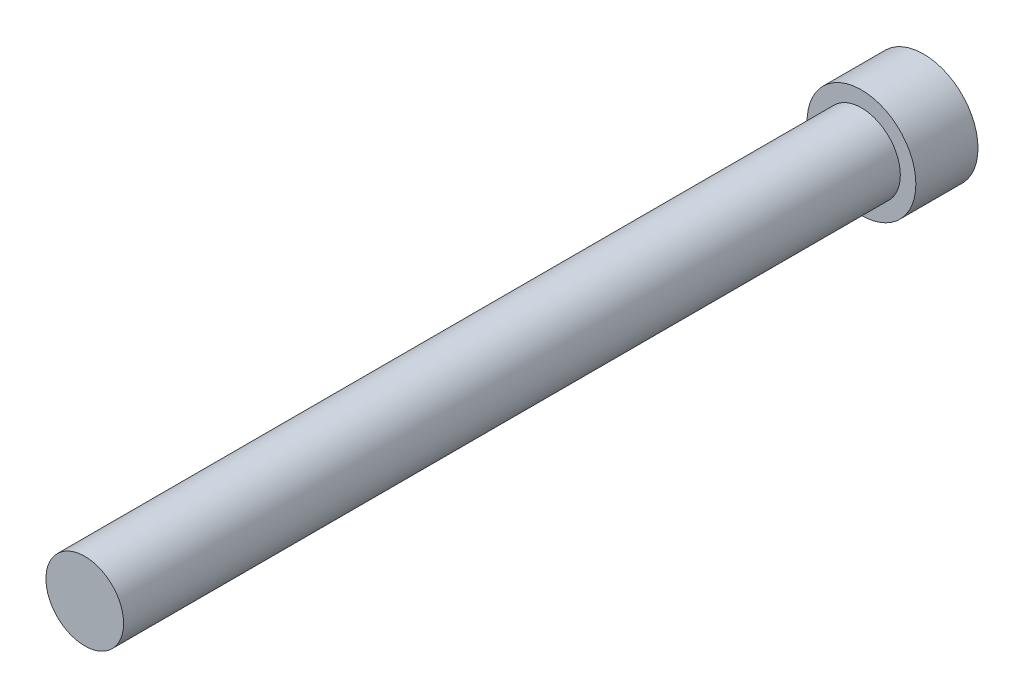
ISO-10303-21;
HEADER;
FILE_DESCRIPTION(('STEP AP214'),'2;1');
FILE_NAME('part.step','',(''),(''),'','','');
FILE_SCHEMA(('AUTOMOTIVE_DESIGN { 1 0 10303 214 1 1 1 1 }'));
ENDSEC;
DATA;
#1=APPLICATION_CONTEXT('core data for automotive mechanical design processes');
#2=APPLICATION_PROTOCOL_DEFINITION('international standard','automotive_design',2000,#1);
#3=PRODUCT_CONTEXT('',#1,'mechanical');
#4=PRODUCT('Part','Part','',(#3));
#5=PRODUCT_RELATED_PRODUCT_CATEGORY('part','',(#4));
#6=PRODUCT_DEFINITION_FORMATION('','',#4);
#7=PRODUCT_DEFINITION_CONTEXT('part definition',#1,'design');
#8=PRODUCT_DEFINITION('design','',#6,#7);
#9=PRODUCT_DEFINITION_SHAPE('','',#8);
#10=(LENGTH_UNIT() NAMED_UNIT(*) SI_UNIT(.MILLI.,.METRE.));
#11=(NAMED_UNIT(*) PLANE_ANGLE_UNIT() SI_UNIT($,.RADIAN.));
#12=(NAMED_UNIT(*) SI_UNIT($,.STERADIAN.) SOLID_ANGLE_UNIT());
#13=UNCERTAINTY_MEASURE_WITH_UNIT(LENGTH_MEASURE(1.E-05),#10,'distance_accuracy_value','');
#14=(GEOMETRIC_REPRESENTATION_CONTEXT(3) GLOBAL_UNCERTAINTY_ASSIGNED_CONTEXT((#13)) GLOBAL_UNIT_ASSIGNED_CONTEXT((#10,
#11,#12)) REPRESENTATION_CONTEXT('',''));
#15=CARTESIAN_POINT('',(0.,0.,0.));
#16=DIRECTION('',(0.,0.,1.));
#17=DIRECTION('',(1.,0.,0.));
#18=AXIS2_PLACEMENT_3D('',#15,#16,#17);
#19=CARTESIAN_POINT('',(0.,0.,68.58));
#20=DIRECTION('',(0.,0.,-1.));
#21=DIRECTION('',(-1.,0.,0.));
#22=AXIS2_PLACEMENT_3D('',#19,#20,#21);
#23=CYLINDRICAL_SURFACE('',#22,4.445);
#24=CARTESIAN_POINT('',(0.,0.,0.));
#25=DIRECTION('',(0.,0.,1.));
#26=DIRECTION('',(1.,0.,0.));
#27=AXIS2_PLACEMENT_3D('',#24,#25,#26);
#28=CIRCLE('',#27,4.445);
#29=CARTESIAN_POINT('',(4.445,0.,0.));
#30=VERTEX_POINT('',#29);
#31=EDGE_CURVE('E11',#30,#30,#28,.T.);
#32=ORIENTED_EDGE('',*,*,#31,.T.);
#33=EDGE_LOOP('',(#32));
#34=FACE_BOUND('',#33,.T.);
#35=CARTESIAN_POINT('',(0.,0.,5.08));
#36=DIRECTION('',(0.,0.,1.));
#37=DIRECTION('',(1.,0.,0.));
#38=AXIS2_PLACEMENT_3D('',#35,#36,#37);
#39=CIRCLE('',#38,4.445);
#40=CARTESIAN_POINT('',(4.445,0.,5.08));
#41=VERTEX_POINT('',#40);
#42=EDGE_CURVE('E39',#41,#41,#39,.T.);
#43=ORIENTED_EDGE('',*,*,#42,.F.);
#44=EDGE_LOOP('',(#43));
#45=FACE_BOUND('',#44,.T.);
#46=ADVANCED_FACE('F36',(#34,#45),#23,.T.);
#47=CARTESIAN_POINT('',(0.,0.,0.));
#48=DIRECTION('',(0.,0.,1.));
#49=DIRECTION('',(1.,0.,0.));
#50=AXIS2_PLACEMENT_3D('',#47,#48,#49);
#51=PLANE('',#50);
#52=ORIENTED_EDGE('',*,*,#31,.F.);
#53=EDGE_LOOP('',(#52));
#54=FACE_BOUND('',#53,.T.);
#55=ADVANCED_FACE('F60',(#54),#51,.F.);
#56=CARTESIAN_POINT('',(0.,0.,5.08));
#57=DIRECTION('',(0.,0.,1.));
#58=DIRECTION('',(1.,0.,0.));
#59=AXIS2_PLACEMENT_3D('',#56,#57,#58);
#60=PLANE('',#59);
#61=CARTESIAN_POINT('',(0.,0.,5.08));
#62=DIRECTION('',(0.,0.,1.));
#63=DIRECTION('',(1.,0.,0.));
#64=AXIS2_PLACEMENT_3D('',#61,#62,#63);
#65=CIRCLE('',#64,3.175);
#66=CARTESIAN_POINT('',(3.175,0.,5.08));
#67=VERTEX_POINT('',#66);
#68=EDGE_CURVE('E46',#67,#67,#65,.T.);
#69=ORIENTED_EDGE('',*,*,#68,.F.);
#70=EDGE_LOOP('',(#69));
#71=FACE_BOUND('',#70,.T.);
#72=ORIENTED_EDGE('',*,*,#42,.T.);
#73=EDGE_LOOP('',(#72));
#74=FACE_BOUND('',#73,.T.);
#75=ADVANCED_FACE('F57',(#71,#74),#60,.T.);
#76=CARTESIAN_POINT('',(0.,0.,5.08));
#77=DIRECTION('',(0.,0.,1.));
#78=DIRECTION('',(1.,0.,0.));
#79=AXIS2_PLACEMENT_3D('',#76,#77,#78);
#80=CYLINDRICAL_SURFACE('',#79,3.175);
#81=ORIENTED_EDGE('',*,*,#68,.T.);
#82=EDGE_LOOP('',(#81));
#83=FACE_BOUND('',#82,.T.);
#84=CARTESIAN_POINT('',(0.,0.,68.58));
#85=DIRECTION('',(0.,0.,1.));
#86=DIRECTION('',(1.,0.,0.));
#87=AXIS2_PLACEMENT_3D('',#84,#85,#86);
#88=CIRCLE('',#87,3.175);
#89=CARTESIAN_POINT('',(3.175,0.,68.58));
#90=VERTEX_POINT('',#89);
#91=EDGE_CURVE('E48',#90,#90,#88,.T.);
#92=ORIENTED_EDGE('',*,*,#91,.F.);
#93=EDGE_LOOP('',(#92));
#94=FACE_BOUND('',#93,.T.);
#95=ADVANCED_FACE('F54',(#83,#94),#80,.T.);
#96=CARTESIAN_POINT('',(0.,0.,68.58));
#97=DIRECTION('',(0.,0.,1.));
#98=DIRECTION('',(1.,0.,0.));
#99=AXIS2_PLACEMENT_3D('',#96,#97,#98);
#100=PLANE('',#99);
#101=ORIENTED_EDGE('',*,*,#91,.T.);
#102=EDGE_LOOP('',(#101));
#103=FACE_BOUND('',#102,.T.);
#104=ADVANCED_FACE('F72',(#103),#100,.T.);
#105=CLOSED_SHELL('',(#46,#55,#75,#95,#104));
#106=MANIFOLD_SOLID_BREP('B2',#105);
#107=ADVANCED_BREP_SHAPE_REPRESENTATION('',(#18,#106),#14);
#108=SHAPE_DEFINITION_REPRESENTATION(#9,#107);
ENDSEC;
END-ISO-10303-21;
